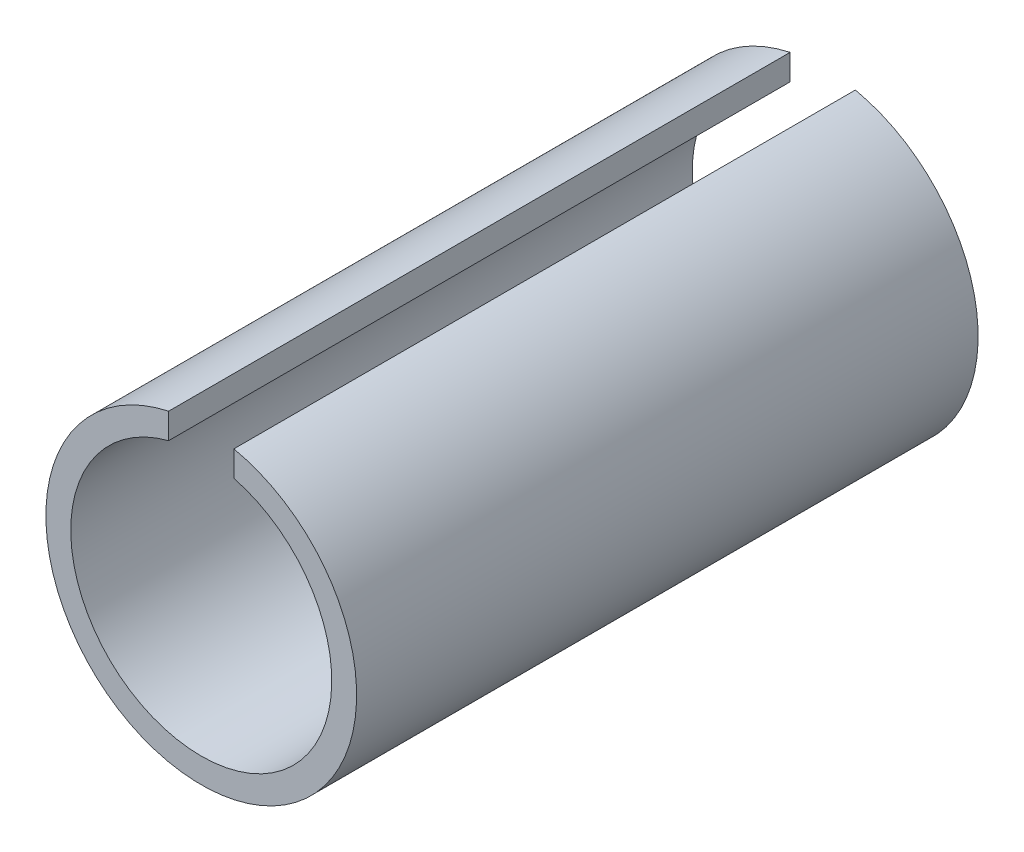
ISO-10303-21;
HEADER;
FILE_DESCRIPTION(('STEP AP214'),'2;1');
FILE_NAME('part.step','',(''),(''),'','','');
FILE_SCHEMA(('AUTOMOTIVE_DESIGN { 1 0 10303 214 1 1 1 1 }'));
ENDSEC;
DATA;
#1=APPLICATION_CONTEXT('core data for automotive mechanical design processes');
#2=APPLICATION_PROTOCOL_DEFINITION('international standard','automotive_design',2000,#1);
#3=PRODUCT_CONTEXT('',#1,'mechanical');
#4=PRODUCT('Part','Part','',(#3));
#5=PRODUCT_RELATED_PRODUCT_CATEGORY('part','',(#4));
#6=PRODUCT_DEFINITION_FORMATION('','',#4);
#7=PRODUCT_DEFINITION_CONTEXT('part definition',#1,'design');
#8=PRODUCT_DEFINITION('design','',#6,#7);
#9=PRODUCT_DEFINITION_SHAPE('','',#8);
#10=(LENGTH_UNIT() NAMED_UNIT(*) SI_UNIT(.MILLI.,.METRE.));
#11=(NAMED_UNIT(*) PLANE_ANGLE_UNIT() SI_UNIT($,.RADIAN.));
#12=(NAMED_UNIT(*) SI_UNIT($,.STERADIAN.) SOLID_ANGLE_UNIT());
#13=UNCERTAINTY_MEASURE_WITH_UNIT(LENGTH_MEASURE(1.E-05),#10,'distance_accuracy_value','');
#14=(GEOMETRIC_REPRESENTATION_CONTEXT(3) GLOBAL_UNCERTAINTY_ASSIGNED_CONTEXT((#13)) GLOBAL_UNIT_ASSIGNED_CONTEXT((#10,
#11,#12)) REPRESENTATION_CONTEXT('',''));
#15=CARTESIAN_POINT('',(0.,0.,0.));
#16=DIRECTION('',(0.,0.,1.));
#17=DIRECTION('',(1.,0.,0.));
#18=AXIS2_PLACEMENT_3D('',#15,#16,#17);
#19=CARTESIAN_POINT('',(0.,0.,19.05));
#20=DIRECTION('',(0.,0.,-1.));
#21=DIRECTION('',(-1.,0.,0.));
#22=AXIS2_PLACEMENT_3D('',#19,#20,#21);
#23=CYLINDRICAL_SURFACE('',#22,4.7625);
#24=CARTESIAN_POINT('',(0.,0.,0.));
#25=DIRECTION('',(0.,0.,1.));
#26=DIRECTION('',(1.,0.,0.));
#27=AXIS2_PLACEMENT_3D('',#24,#25,#26);
#28=CIRCLE('',#27,4.7625);
#29=CARTESIAN_POINT('',(-1.,4.65632969730452,0.));
#30=VERTEX_POINT('',#29);
#31=CARTESIAN_POINT('',(1.,4.65632969730452,0.));
#32=VERTEX_POINT('',#31);
#33=EDGE_CURVE('E96',#30,#32,#28,.T.);
#34=ORIENTED_EDGE('',*,*,#33,.T.);
#35=DIRECTION('',(0.,0.,-1.));
#36=VECTOR('',#35,1.);
#37=CARTESIAN_POINT('',(1.,4.65632969730452,19.05));
#38=LINE('',#37,#36);
#39=CARTESIAN_POINT('',(1.,4.65632969730452,19.05));
#40=VERTEX_POINT('',#39);
#41=EDGE_CURVE('E11',#40,#32,#38,.T.);
#42=ORIENTED_EDGE('',*,*,#41,.F.);
#43=CARTESIAN_POINT('',(0.,0.,19.05));
#44=DIRECTION('',(0.,0.,1.));
#45=DIRECTION('',(1.,0.,0.));
#46=AXIS2_PLACEMENT_3D('',#43,#44,#45);
#47=CIRCLE('',#46,4.7625);
#48=CARTESIAN_POINT('',(-1.,4.65632969730452,19.05));
#49=VERTEX_POINT('',#48);
#50=EDGE_CURVE('E84',#49,#40,#47,.T.);
#51=ORIENTED_EDGE('',*,*,#50,.F.);
#52=DIRECTION('',(0.,0.,-1.));
#53=VECTOR('',#52,1.);
#54=CARTESIAN_POINT('',(-1.,4.65632969730452,19.05));
#55=LINE('',#54,#53);
#56=EDGE_CURVE('E92',#49,#30,#55,.T.);
#57=ORIENTED_EDGE('',*,*,#56,.T.);
#58=EDGE_LOOP('',(#34,#42,#51,#57));
#59=FACE_BOUND('',#58,.T.);
#60=ADVANCED_FACE('F33',(#59),#23,.T.);
#61=CARTESIAN_POINT('',(1.,3.87298334620742,19.05));
#62=DIRECTION('',(1.,0.,0.));
#63=DIRECTION('',(0.,0.,-1.));
#64=AXIS2_PLACEMENT_3D('',#61,#62,#63);
#65=PLANE('',#64);
#66=DIRECTION('',(0.,-1.,0.));
#67=VECTOR('',#66,1.);
#68=CARTESIAN_POINT('',(1.,3.87298334620742,0.));
#69=LINE('',#68,#67);
#70=CARTESIAN_POINT('',(1.,3.87298334620742,0.));
#71=VERTEX_POINT('',#70);
#72=EDGE_CURVE('E88',#32,#71,#69,.T.);
#73=ORIENTED_EDGE('',*,*,#72,.T.);
#74=DIRECTION('',(0.,0.,-1.));
#75=VECTOR('',#74,1.);
#76=CARTESIAN_POINT('',(1.,3.87298334620742,19.05));
#77=LINE('',#76,#75);
#78=CARTESIAN_POINT('',(1.,3.87298334620742,19.05));
#79=VERTEX_POINT('',#78);
#80=EDGE_CURVE('E41',#79,#71,#77,.T.);
#81=ORIENTED_EDGE('',*,*,#80,.F.);
#82=DIRECTION('',(0.,-1.,0.));
#83=VECTOR('',#82,1.);
#84=CARTESIAN_POINT('',(1.,3.87298334620742,19.05));
#85=LINE('',#84,#83);
#86=EDGE_CURVE('E79',#40,#79,#85,.T.);
#87=ORIENTED_EDGE('',*,*,#86,.F.);
#88=ORIENTED_EDGE('',*,*,#41,.T.);
#89=EDGE_LOOP('',(#73,#81,#87,#88));
#90=FACE_BOUND('',#89,.T.);
#91=ADVANCED_FACE('F87',(#90),#65,.F.);
#92=CARTESIAN_POINT('',(0.,0.,19.05));
#93=DIRECTION('',(0.,0.,-1.));
#94=DIRECTION('',(-1.,0.,0.));
#95=AXIS2_PLACEMENT_3D('',#92,#93,#94);
#96=CYLINDRICAL_SURFACE('',#95,4.);
#97=CARTESIAN_POINT('',(0.,0.,0.));
#98=DIRECTION('',(0.,0.,-1.));
#99=DIRECTION('',(1.,0.,0.));
#100=AXIS2_PLACEMENT_3D('',#97,#98,#99);
#101=CIRCLE('',#100,4.);
#102=CARTESIAN_POINT('',(-1.,3.87298334620742,0.));
#103=VERTEX_POINT('',#102);
#104=EDGE_CURVE('E66',#71,#103,#101,.T.);
#105=ORIENTED_EDGE('',*,*,#104,.T.);
#106=DIRECTION('',(0.,0.,-1.));
#107=VECTOR('',#106,1.);
#108=CARTESIAN_POINT('',(-1.,3.87298334620742,19.05));
#109=LINE('',#108,#107);
#110=CARTESIAN_POINT('',(-1.,3.87298334620742,19.05));
#111=VERTEX_POINT('',#110);
#112=EDGE_CURVE('E89',#111,#103,#109,.T.);
#113=ORIENTED_EDGE('',*,*,#112,.F.);
#114=CARTESIAN_POINT('',(0.,0.,19.05));
#115=DIRECTION('',(0.,0.,-1.));
#116=DIRECTION('',(1.,0.,0.));
#117=AXIS2_PLACEMENT_3D('',#114,#115,#116);
#118=CIRCLE('',#117,4.);
#119=EDGE_CURVE('E82',#79,#111,#118,.T.);
#120=ORIENTED_EDGE('',*,*,#119,.F.);
#121=ORIENTED_EDGE('',*,*,#80,.T.);
#122=EDGE_LOOP('',(#105,#113,#120,#121));
#123=FACE_BOUND('',#122,.T.);
#124=ADVANCED_FACE('F90',(#123),#96,.F.);
#125=CARTESIAN_POINT('',(-1.,3.87298334620742,19.05));
#126=DIRECTION('',(-1.,0.,0.));
#127=DIRECTION('',(0.,0.,1.));
#128=AXIS2_PLACEMENT_3D('',#125,#126,#127);
#129=PLANE('',#128);
#130=DIRECTION('',(0.,1.,0.));
#131=VECTOR('',#130,1.);
#132=CARTESIAN_POINT('',(-1.,3.87298334620742,0.));
#133=LINE('',#132,#131);
#134=EDGE_CURVE('E72',#103,#30,#133,.T.);
#135=ORIENTED_EDGE('',*,*,#134,.T.);
#136=ORIENTED_EDGE('',*,*,#56,.F.);
#137=DIRECTION('',(0.,1.,0.));
#138=VECTOR('',#137,1.);
#139=CARTESIAN_POINT('',(-1.,3.87298334620742,19.05));
#140=LINE('',#139,#138);
#141=EDGE_CURVE('E49',#111,#49,#140,.T.);
#142=ORIENTED_EDGE('',*,*,#141,.F.);
#143=ORIENTED_EDGE('',*,*,#112,.T.);
#144=EDGE_LOOP('',(#135,#136,#142,#143));
#145=FACE_BOUND('',#144,.T.);
#146=ADVANCED_FACE('F103',(#145),#129,.F.);
#147=CARTESIAN_POINT('',(0.,0.,19.05));
#148=DIRECTION('',(0.,0.,1.));
#149=DIRECTION('',(1.,0.,0.));
#150=AXIS2_PLACEMENT_3D('',#147,#148,#149);
#151=PLANE('',#150);
#152=ORIENTED_EDGE('',*,*,#50,.T.);
#153=ORIENTED_EDGE('',*,*,#86,.T.);
#154=ORIENTED_EDGE('',*,*,#119,.T.);
#155=ORIENTED_EDGE('',*,*,#141,.T.);
#156=EDGE_LOOP('',(#152,#153,#154,#155));
#157=FACE_BOUND('',#156,.T.);
#158=ADVANCED_FACE('F80',(#157),#151,.T.);
#159=CARTESIAN_POINT('',(0.,0.,0.));
#160=DIRECTION('',(0.,0.,1.));
#161=DIRECTION('',(1.,0.,0.));
#162=AXIS2_PLACEMENT_3D('',#159,#160,#161);
#163=PLANE('',#162);
#164=ORIENTED_EDGE('',*,*,#33,.F.);
#165=ORIENTED_EDGE('',*,*,#134,.F.);
#166=ORIENTED_EDGE('',*,*,#104,.F.);
#167=ORIENTED_EDGE('',*,*,#72,.F.);
#168=EDGE_LOOP('',(#164,#165,#166,#167));
#169=FACE_BOUND('',#168,.T.);
#170=ADVANCED_FACE('F106',(#169),#163,.F.);
#171=CLOSED_SHELL('',(#60,#91,#124,#146,#158,#170));
#172=MANIFOLD_SOLID_BREP('B2',#171);
#173=ADVANCED_BREP_SHAPE_REPRESENTATION('',(#18,#172),#14);
#174=SHAPE_DEFINITION_REPRESENTATION(#9,#173);
ENDSEC;
END-ISO-10303-21;
